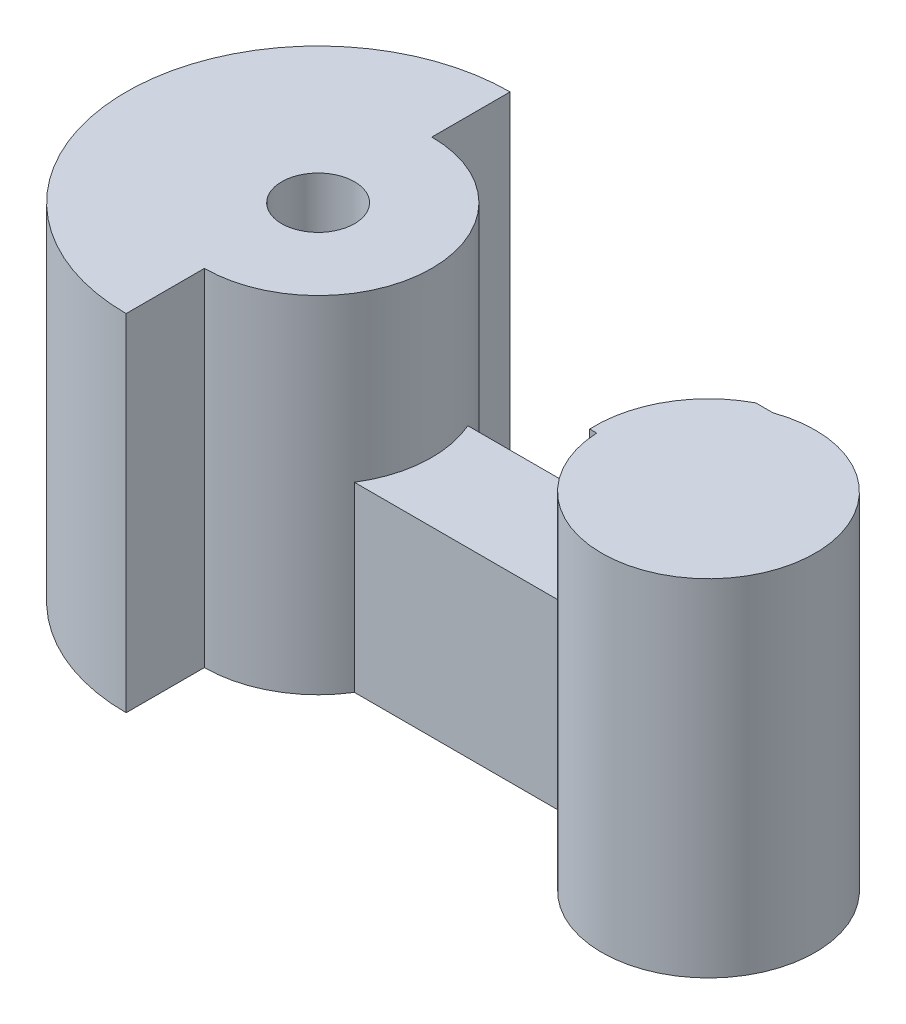
ISO-10303-21;
HEADER;
FILE_DESCRIPTION(('STEP AP214'),'2;1');
FILE_NAME('part.step','',(''),(''),'','','');
FILE_SCHEMA(('AUTOMOTIVE_DESIGN { 1 0 10303 214 1 1 1 1 }'));
ENDSEC;
DATA;
#1=APPLICATION_CONTEXT('core data for automotive mechanical design processes');
#2=APPLICATION_PROTOCOL_DEFINITION('international standard','automotive_design',2000,#1);
#3=PRODUCT_CONTEXT('',#1,'mechanical');
#4=PRODUCT('Part','Part','',(#3));
#5=PRODUCT_RELATED_PRODUCT_CATEGORY('part','',(#4));
#6=PRODUCT_DEFINITION_FORMATION('','',#4);
#7=PRODUCT_DEFINITION_CONTEXT('part definition',#1,'design');
#8=PRODUCT_DEFINITION('design','',#6,#7);
#9=PRODUCT_DEFINITION_SHAPE('','',#8);
#10=(LENGTH_UNIT() NAMED_UNIT(*) SI_UNIT(.MILLI.,.METRE.));
#11=(NAMED_UNIT(*) PLANE_ANGLE_UNIT() SI_UNIT($,.RADIAN.));
#12=(NAMED_UNIT(*) SI_UNIT($,.STERADIAN.) SOLID_ANGLE_UNIT());
#13=UNCERTAINTY_MEASURE_WITH_UNIT(LENGTH_MEASURE(1.E-05),#10,'distance_accuracy_value','');
#14=(GEOMETRIC_REPRESENTATION_CONTEXT(3) GLOBAL_UNCERTAINTY_ASSIGNED_CONTEXT((#13)) GLOBAL_UNIT_ASSIGNED_CONTEXT((#10,
#11,#12)) REPRESENTATION_CONTEXT('',''));
#15=CARTESIAN_POINT('',(0.,0.,0.));
#16=DIRECTION('',(0.,0.,1.));
#17=DIRECTION('',(1.,0.,0.));
#18=AXIS2_PLACEMENT_3D('',#15,#16,#17);
#19=CARTESIAN_POINT('',(0.,-4.826,-0.440697151861405));
#20=DIRECTION('',(0.,0.,1.));
#21=DIRECTION('',(1.,0.,0.));
#22=AXIS2_PLACEMENT_3D('',#19,#20,#21);
#23=PLANE('',#22);
#24=DIRECTION('',(0.,1.,0.));
#25=VECTOR('',#24,1.);
#26=CARTESIAN_POINT('',(16.6658362887313,0.254,-0.440697151861405));
#27=LINE('',#26,#25);
#28=CARTESIAN_POINT('',(16.6658362887313,0.254,-0.440697151861405));
#29=VERTEX_POINT('',#28);
#30=CARTESIAN_POINT('',(16.6658362887313,4.826,-0.440697151861405));
#31=VERTEX_POINT('',#30);
#32=EDGE_CURVE('E203',#29,#31,#27,.T.);
#33=ORIENTED_EDGE('',*,*,#32,.T.);
#34=DIRECTION('',(1.,0.,0.));
#35=VECTOR('',#34,1.);
#36=CARTESIAN_POINT('',(0.,4.826,-0.440697151861405));
#37=LINE('',#36,#35);
#38=CARTESIAN_POINT('',(17.1479715996403,4.826,-0.440697151861405));
#39=VERTEX_POINT('',#38);
#40=EDGE_CURVE('E178',#31,#39,#37,.T.);
#41=ORIENTED_EDGE('',*,*,#40,.T.);
#42=DIRECTION('',(0.,1.,0.));
#43=VECTOR('',#42,1.);
#44=CARTESIAN_POINT('',(17.1479715996403,-4.826,-0.440697151861405));
#45=LINE('',#44,#43);
#46=CARTESIAN_POINT('',(17.1479715996403,-4.826,-0.440697151861405));
#47=VERTEX_POINT('',#46);
#48=EDGE_CURVE('E48',#47,#39,#45,.T.);
#49=ORIENTED_EDGE('',*,*,#48,.F.);
#50=DIRECTION('',(1.,0.,0.));
#51=VECTOR('',#50,1.);
#52=CARTESIAN_POINT('',(0.,-4.826,-0.440697151861405));
#53=LINE('',#52,#51);
#54=CARTESIAN_POINT('',(8.62790716593727,-4.826,-0.440697151861405));
#55=VERTEX_POINT('',#54);
#56=EDGE_CURVE('E158',#55,#47,#53,.T.);
#57=ORIENTED_EDGE('',*,*,#56,.F.);
#58=DIRECTION('',(0.,1.,0.));
#59=VECTOR('',#58,1.);
#60=CARTESIAN_POINT('',(8.62790716593727,-4.826,-0.440697151861405));
#61=LINE('',#60,#59);
#62=CARTESIAN_POINT('',(8.62790716593727,0.254,-0.440697151861405));
#63=VERTEX_POINT('',#62);
#64=EDGE_CURVE('E11',#55,#63,#61,.T.);
#65=ORIENTED_EDGE('',*,*,#64,.T.);
#66=DIRECTION('',(-1.,0.,0.));
#67=VECTOR('',#66,1.);
#68=CARTESIAN_POINT('',(0.,0.254,-0.440697151861405));
#69=LINE('',#68,#67);
#70=EDGE_CURVE('E123',#29,#63,#69,.T.);
#71=ORIENTED_EDGE('',*,*,#70,.F.);
#72=EDGE_LOOP('',(#33,#41,#49,#57,#65,#71));
#73=FACE_BOUND('',#72,.T.);
#74=ADVANCED_FACE('F39',(#73),#23,.F.);
#75=CARTESIAN_POINT('',(0.,-4.826,2.50951856127225));
#76=DIRECTION('',(0.,0.,1.));
#77=DIRECTION('',(1.,0.,0.));
#78=AXIS2_PLACEMENT_3D('',#75,#76,#77);
#79=PLANE('',#78);
#80=DIRECTION('',(1.,0.,0.));
#81=VECTOR('',#80,1.);
#82=CARTESIAN_POINT('',(0.,4.826,2.50951856127225));
#83=LINE('',#82,#81);
#84=CARTESIAN_POINT('',(14.979501919333,4.826,2.50951856127225));
#85=VERTEX_POINT('',#84);
#86=CARTESIAN_POINT('',(15.1746561132119,4.826,2.50951856127225));
#87=VERTEX_POINT('',#86);
#88=EDGE_CURVE('E179',#85,#87,#83,.T.);
#89=ORIENTED_EDGE('',*,*,#88,.F.);
#90=DIRECTION('',(0.,1.,0.));
#91=VECTOR('',#90,1.);
#92=CARTESIAN_POINT('',(14.979501919333,0.254,2.50951856127225));
#93=LINE('',#92,#91);
#94=CARTESIAN_POINT('',(14.979501919333,0.254,2.50951856127225));
#95=VERTEX_POINT('',#94);
#96=EDGE_CURVE('E56',#95,#85,#93,.T.);
#97=ORIENTED_EDGE('',*,*,#96,.F.);
#98=DIRECTION('',(1.,0.,0.));
#99=VECTOR('',#98,1.);
#100=CARTESIAN_POINT('',(0.,0.254,2.50951856127225));
#101=LINE('',#100,#99);
#102=CARTESIAN_POINT('',(8.41194638744713,0.254,2.50951856127225));
#103=VERTEX_POINT('',#102);
#104=EDGE_CURVE('E121',#103,#95,#101,.T.);
#105=ORIENTED_EDGE('',*,*,#104,.F.);
#106=DIRECTION('',(0.,1.,0.));
#107=VECTOR('',#106,1.);
#108=CARTESIAN_POINT('',(8.41194638744713,-4.826,2.50951856127225));
#109=LINE('',#108,#107);
#110=CARTESIAN_POINT('',(8.41194638744713,-4.826,2.50951856127225));
#111=VERTEX_POINT('',#110);
#112=EDGE_CURVE('E131',#111,#103,#109,.T.);
#113=ORIENTED_EDGE('',*,*,#112,.F.);
#114=DIRECTION('',(1.,0.,0.));
#115=VECTOR('',#114,1.);
#116=CARTESIAN_POINT('',(0.,-4.826,2.50951856127225));
#117=LINE('',#116,#115);
#118=CARTESIAN_POINT('',(15.1746561132119,-4.826,2.50951856127225));
#119=VERTEX_POINT('',#118);
#120=EDGE_CURVE('E198',#111,#119,#117,.T.);
#121=ORIENTED_EDGE('',*,*,#120,.T.);
#122=DIRECTION('',(0.,1.,0.));
#123=VECTOR('',#122,1.);
#124=CARTESIAN_POINT('',(15.1746561132119,-4.826,2.50951856127225));
#125=LINE('',#124,#123);
#126=EDGE_CURVE('E139',#119,#87,#125,.T.);
#127=ORIENTED_EDGE('',*,*,#126,.T.);
#128=EDGE_LOOP('',(#89,#97,#105,#113,#121,#127));
#129=FACE_BOUND('',#128,.T.);
#130=ADVANCED_FACE('F129',(#129),#79,.T.);
#131=CARTESIAN_POINT('',(0.,4.826,0.));
#132=DIRECTION('',(0.,1.,0.));
#133=DIRECTION('',(0.,0.,1.));
#134=AXIS2_PLACEMENT_3D('',#131,#132,#133);
#135=PLANE('',#134);
#136=CARTESIAN_POINT('',(5.71797159964031,4.826,0.829302848138595));
#137=DIRECTION('',(0.,1.,0.));
#138=DIRECTION('',(0.,0.,1.));
#139=AXIS2_PLACEMENT_3D('',#136,#137,#138);
#140=CIRCLE('',#139,1.016);
#141=CARTESIAN_POINT('',(5.71797159964031,4.826,1.84530284813859));
#142=VERTEX_POINT('',#141);
#143=EDGE_CURVE('E181',#142,#142,#140,.T.);
#144=ORIENTED_EDGE('',*,*,#143,.F.);
#145=EDGE_LOOP('',(#144));
#146=FACE_BOUND('',#145,.T.);
#147=DIRECTION('',(0.,0.,1.));
#148=VECTOR('',#147,1.);
#149=CARTESIAN_POINT('',(5.71797159964031,4.826,0.));
#150=LINE('',#149,#148);
#151=CARTESIAN_POINT('',(5.71797159964031,4.826,4.0043028481386));
#152=VERTEX_POINT('',#151);
#153=CARTESIAN_POINT('',(5.71797159964031,4.826,6.18888102010782));
#154=VERTEX_POINT('',#153);
#155=EDGE_CURVE('E183',#152,#154,#150,.T.);
#156=ORIENTED_EDGE('',*,*,#155,.F.);
#157=CARTESIAN_POINT('',(5.71797159964031,4.826,0.829302848138595));
#158=DIRECTION('',(0.,1.,0.));
#159=DIRECTION('',(0.,0.,1.));
#160=AXIS2_PLACEMENT_3D('',#157,#158,#159);
#161=CIRCLE('',#160,3.175);
#162=CARTESIAN_POINT('',(5.71797159964031,4.826,-2.34569715186141));
#163=VERTEX_POINT('',#162);
#164=EDGE_CURVE('E209',#152,#163,#161,.T.);
#165=ORIENTED_EDGE('',*,*,#164,.T.);
#166=DIRECTION('',(0.,0.,1.));
#167=VECTOR('',#166,1.);
#168=CARTESIAN_POINT('',(5.71797159964031,4.826,0.));
#169=LINE('',#168,#167);
#170=CARTESIAN_POINT('',(5.71797159964031,4.826,-4.53027532383063));
#171=VERTEX_POINT('',#170);
#172=EDGE_CURVE('E212',#171,#163,#169,.T.);
#173=ORIENTED_EDGE('',*,*,#172,.F.);
#174=CARTESIAN_POINT('',(5.71797159964031,4.826,0.829302848138595));
#175=DIRECTION('',(0.,1.,0.));
#176=DIRECTION('',(0.,0.,1.));
#177=AXIS2_PLACEMENT_3D('',#174,#175,#176);
#178=CIRCLE('',#177,5.35957817196923);
#179=EDGE_CURVE('E214',#171,#154,#178,.T.);
#180=ORIENTED_EDGE('',*,*,#179,.T.);
#181=EDGE_LOOP('',(#156,#165,#173,#180));
#182=FACE_BOUND('',#181,.T.);
#183=ADVANCED_FACE('F223',(#146,#182),#135,.T.);
#184=ORIENTED_EDGE('',*,*,#40,.F.);
#185=CARTESIAN_POINT('',(18.1512297466703,4.826,2.3654089179642));
#186=DIRECTION('',(0.,1.,0.));
#187=DIRECTION('',(0.,0.,1.));
#188=AXIS2_PLACEMENT_3D('',#185,#186,#187);
#189=CIRCLE('',#188,3.175);
#190=EDGE_CURVE('E125',#31,#85,#189,.T.);
#191=ORIENTED_EDGE('',*,*,#190,.T.);
#192=ORIENTED_EDGE('',*,*,#88,.T.);
#193=CARTESIAN_POINT('',(18.1512297466703,4.826,2.3654089179642));
#194=DIRECTION('',(0.,1.,0.));
#195=DIRECTION('',(0.,0.,1.));
#196=AXIS2_PLACEMENT_3D('',#193,#194,#195);
#197=CIRCLE('',#196,2.98006009749706);
#198=EDGE_CURVE('E172',#87,#39,#197,.T.);
#199=ORIENTED_EDGE('',*,*,#198,.T.);
#200=EDGE_LOOP('',(#184,#191,#192,#199));
#201=FACE_BOUND('',#200,.T.);
#202=ADVANCED_FACE('F177',(#201),#135,.T.);
#203=CARTESIAN_POINT('',(18.1512297466703,-4.826,2.3654089179642));
#204=DIRECTION('',(0.,1.,0.));
#205=DIRECTION('',(0.,0.,1.));
#206=AXIS2_PLACEMENT_3D('',#203,#204,#205);
#207=CYLINDRICAL_SURFACE('',#206,2.98006009749706);
#208=ORIENTED_EDGE('',*,*,#48,.T.);
#209=ORIENTED_EDGE('',*,*,#198,.F.);
#210=ORIENTED_EDGE('',*,*,#126,.F.);
#211=CARTESIAN_POINT('',(18.1512297466703,-4.826,2.3654089179642));
#212=DIRECTION('',(0.,1.,0.));
#213=DIRECTION('',(0.,0.,1.));
#214=AXIS2_PLACEMENT_3D('',#211,#212,#213);
#215=CIRCLE('',#214,2.98006009749706);
#216=EDGE_CURVE('E162',#119,#47,#215,.T.);
#217=ORIENTED_EDGE('',*,*,#216,.T.);
#218=EDGE_LOOP('',(#208,#209,#210,#217));
#219=FACE_BOUND('',#218,.T.);
#220=ADVANCED_FACE('F171',(#219),#207,.T.);
#221=CARTESIAN_POINT('',(5.71797159964031,-4.826,0.829302848138595));
#222=DIRECTION('',(0.,1.,0.));
#223=DIRECTION('',(0.,0.,1.));
#224=AXIS2_PLACEMENT_3D('',#221,#222,#223);
#225=CYLINDRICAL_SURFACE('',#224,3.175);
#226=ORIENTED_EDGE('',*,*,#112,.T.);
#227=CARTESIAN_POINT('',(5.71797159964031,0.254,0.829302848138595));
#228=DIRECTION('',(0.,1.,0.));
#229=DIRECTION('',(0.,0.,1.));
#230=AXIS2_PLACEMENT_3D('',#227,#228,#229);
#231=CIRCLE('',#230,3.175);
#232=EDGE_CURVE('E117',#103,#63,#231,.T.);
#233=ORIENTED_EDGE('',*,*,#232,.T.);
#234=ORIENTED_EDGE('',*,*,#64,.F.);
#235=CARTESIAN_POINT('',(5.71797159964031,-4.826,0.829302848138595));
#236=DIRECTION('',(0.,1.,0.));
#237=DIRECTION('',(0.,0.,1.));
#238=AXIS2_PLACEMENT_3D('',#235,#236,#237);
#239=CIRCLE('',#238,3.175);
#240=CARTESIAN_POINT('',(5.71797159964031,-4.826,-2.34569715186141));
#241=VERTEX_POINT('',#240);
#242=EDGE_CURVE('E189',#55,#241,#239,.T.);
#243=ORIENTED_EDGE('',*,*,#242,.T.);
#244=DIRECTION('',(0.,1.,0.));
#245=VECTOR('',#244,1.);
#246=CARTESIAN_POINT('',(5.71797159964031,-4.826,-2.34569715186141));
#247=LINE('',#246,#245);
#248=EDGE_CURVE('E43',#241,#163,#247,.T.);
#249=ORIENTED_EDGE('',*,*,#248,.T.);
#250=ORIENTED_EDGE('',*,*,#164,.F.);
#251=DIRECTION('',(0.,1.,0.));
#252=VECTOR('',#251,1.);
#253=CARTESIAN_POINT('',(5.71797159964031,-4.826,4.0043028481386));
#254=LINE('',#253,#252);
#255=CARTESIAN_POINT('',(5.71797159964031,-4.826,4.0043028481386));
#256=VERTEX_POINT('',#255);
#257=EDGE_CURVE('E140',#256,#152,#254,.T.);
#258=ORIENTED_EDGE('',*,*,#257,.F.);
#259=EDGE_CURVE('E138',#256,#111,#239,.T.);
#260=ORIENTED_EDGE('',*,*,#259,.T.);
#261=EDGE_LOOP('',(#226,#233,#234,#243,#249,#250,#258,#260));
#262=FACE_BOUND('',#261,.T.);
#263=ADVANCED_FACE('F136',(#262),#225,.T.);
#264=CARTESIAN_POINT('',(5.71797159964031,-4.826,0.));
#265=DIRECTION('',(-1.,0.,0.));
#266=DIRECTION('',(0.,0.,1.));
#267=AXIS2_PLACEMENT_3D('',#264,#265,#266);
#268=PLANE('',#267);
#269=ORIENTED_EDGE('',*,*,#257,.T.);
#270=ORIENTED_EDGE('',*,*,#155,.T.);
#271=DIRECTION('',(0.,1.,0.));
#272=VECTOR('',#271,1.);
#273=CARTESIAN_POINT('',(5.71797159964031,-4.826,6.18888102010782));
#274=LINE('',#273,#272);
#275=CARTESIAN_POINT('',(5.71797159964031,-4.826,6.18888102010782));
#276=VERTEX_POINT('',#275);
#277=EDGE_CURVE('E145',#276,#154,#274,.T.);
#278=ORIENTED_EDGE('',*,*,#277,.F.);
#279=DIRECTION('',(0.,0.,1.));
#280=VECTOR('',#279,1.);
#281=CARTESIAN_POINT('',(5.71797159964031,-4.826,0.));
#282=LINE('',#281,#280);
#283=EDGE_CURVE('E196',#256,#276,#282,.T.);
#284=ORIENTED_EDGE('',*,*,#283,.F.);
#285=EDGE_LOOP('',(#269,#270,#278,#284));
#286=FACE_BOUND('',#285,.T.);
#287=ADVANCED_FACE('F220',(#286),#268,.F.);
#288=CARTESIAN_POINT('',(5.71797159964031,-4.826,0.829302848138595));
#289=DIRECTION('',(0.,1.,0.));
#290=DIRECTION('',(0.,0.,1.));
#291=AXIS2_PLACEMENT_3D('',#288,#289,#290);
#292=CYLINDRICAL_SURFACE('',#291,5.35957817196923);
#293=ORIENTED_EDGE('',*,*,#277,.T.);
#294=ORIENTED_EDGE('',*,*,#179,.F.);
#295=DIRECTION('',(0.,1.,0.));
#296=VECTOR('',#295,1.);
#297=CARTESIAN_POINT('',(5.71797159964031,-4.826,-4.53027532383063));
#298=LINE('',#297,#296);
#299=CARTESIAN_POINT('',(5.71797159964031,-4.826,-4.53027532383063));
#300=VERTEX_POINT('',#299);
#301=EDGE_CURVE('E149',#300,#171,#298,.T.);
#302=ORIENTED_EDGE('',*,*,#301,.F.);
#303=CARTESIAN_POINT('',(5.71797159964031,-4.826,0.829302848138595));
#304=DIRECTION('',(0.,1.,0.));
#305=DIRECTION('',(0.,0.,1.));
#306=AXIS2_PLACEMENT_3D('',#303,#304,#305);
#307=CIRCLE('',#306,5.35957817196923);
#308=EDGE_CURVE('E193',#300,#276,#307,.T.);
#309=ORIENTED_EDGE('',*,*,#308,.T.);
#310=EDGE_LOOP('',(#293,#294,#302,#309));
#311=FACE_BOUND('',#310,.T.);
#312=ADVANCED_FACE('F226',(#311),#292,.T.);
#313=CARTESIAN_POINT('',(5.71797159964031,-4.826,0.));
#314=DIRECTION('',(-1.,0.,0.));
#315=DIRECTION('',(0.,0.,1.));
#316=AXIS2_PLACEMENT_3D('',#313,#314,#315);
#317=PLANE('',#316);
#318=ORIENTED_EDGE('',*,*,#301,.T.);
#319=ORIENTED_EDGE('',*,*,#172,.T.);
#320=ORIENTED_EDGE('',*,*,#248,.F.);
#321=DIRECTION('',(0.,0.,1.));
#322=VECTOR('',#321,1.);
#323=CARTESIAN_POINT('',(5.71797159964031,-4.826,0.));
#324=LINE('',#323,#322);
#325=EDGE_CURVE('E191',#300,#241,#324,.T.);
#326=ORIENTED_EDGE('',*,*,#325,.F.);
#327=EDGE_LOOP('',(#318,#319,#320,#326));
#328=FACE_BOUND('',#327,.T.);
#329=ADVANCED_FACE('F41',(#328),#317,.F.);
#330=CARTESIAN_POINT('',(5.71797159964031,-4.826,0.829302848138595));
#331=DIRECTION('',(0.,1.,0.));
#332=DIRECTION('',(0.,0.,1.));
#333=AXIS2_PLACEMENT_3D('',#330,#331,#332);
#334=CYLINDRICAL_SURFACE('',#333,1.016);
#335=CARTESIAN_POINT('',(5.71797159964031,-4.826,0.829302848138595));
#336=DIRECTION('',(0.,1.,0.));
#337=DIRECTION('',(0.,0.,1.));
#338=AXIS2_PLACEMENT_3D('',#335,#336,#337);
#339=CIRCLE('',#338,1.016);
#340=CARTESIAN_POINT('',(5.71797159964031,-4.826,1.84530284813859));
#341=VERTEX_POINT('',#340);
#342=EDGE_CURVE('E154',#341,#341,#339,.T.);
#343=ORIENTED_EDGE('',*,*,#342,.F.);
#344=EDGE_LOOP('',(#343));
#345=FACE_BOUND('',#344,.T.);
#346=ORIENTED_EDGE('',*,*,#143,.T.);
#347=EDGE_LOOP('',(#346));
#348=FACE_BOUND('',#347,.T.);
#349=ADVANCED_FACE('F229',(#345,#348),#334,.F.);
#350=CARTESIAN_POINT('',(0.,-4.826,0.));
#351=DIRECTION('',(0.,1.,0.));
#352=DIRECTION('',(0.,0.,1.));
#353=AXIS2_PLACEMENT_3D('',#350,#351,#352);
#354=PLANE('',#353);
#355=ORIENTED_EDGE('',*,*,#242,.F.);
#356=ORIENTED_EDGE('',*,*,#56,.T.);
#357=ORIENTED_EDGE('',*,*,#216,.F.);
#358=ORIENTED_EDGE('',*,*,#120,.F.);
#359=ORIENTED_EDGE('',*,*,#259,.F.);
#360=ORIENTED_EDGE('',*,*,#283,.T.);
#361=ORIENTED_EDGE('',*,*,#308,.F.);
#362=ORIENTED_EDGE('',*,*,#325,.T.);
#363=EDGE_LOOP('',(#355,#356,#357,#358,#359,#360,#361,#362));
#364=FACE_BOUND('',#363,.T.);
#365=ORIENTED_EDGE('',*,*,#342,.T.);
#366=EDGE_LOOP('',(#365));
#367=FACE_BOUND('',#366,.T.);
#368=ADVANCED_FACE('F201',(#364,#367),#354,.F.);
#369=CARTESIAN_POINT('',(18.1512297466703,0.254,2.3654089179642));
#370=DIRECTION('',(0.,1.,0.));
#371=DIRECTION('',(0.,0.,1.));
#372=AXIS2_PLACEMENT_3D('',#369,#370,#371);
#373=CYLINDRICAL_SURFACE('',#372,3.175);
#374=ORIENTED_EDGE('',*,*,#190,.F.);
#375=ORIENTED_EDGE('',*,*,#32,.F.);
#376=CARTESIAN_POINT('',(18.1512297466703,0.254,2.3654089179642));
#377=DIRECTION('',(0.,1.,0.));
#378=DIRECTION('',(0.,0.,1.));
#379=AXIS2_PLACEMENT_3D('',#376,#377,#378);
#380=CIRCLE('',#379,3.175);
#381=EDGE_CURVE('E133',#29,#95,#380,.T.);
#382=ORIENTED_EDGE('',*,*,#381,.T.);
#383=ORIENTED_EDGE('',*,*,#96,.T.);
#384=EDGE_LOOP('',(#374,#375,#382,#383));
#385=FACE_BOUND('',#384,.T.);
#386=ADVANCED_FACE('F277',(#385),#373,.T.);
#387=CARTESIAN_POINT('',(0.,0.254,0.));
#388=DIRECTION('',(0.,1.,0.));
#389=DIRECTION('',(0.,0.,1.));
#390=AXIS2_PLACEMENT_3D('',#387,#388,#389);
#391=PLANE('',#390);
#392=ORIENTED_EDGE('',*,*,#232,.F.);
#393=ORIENTED_EDGE('',*,*,#104,.T.);
#394=ORIENTED_EDGE('',*,*,#381,.F.);
#395=ORIENTED_EDGE('',*,*,#70,.T.);
#396=EDGE_LOOP('',(#392,#393,#394,#395));
#397=FACE_BOUND('',#396,.T.);
#398=ADVANCED_FACE('F119',(#397),#391,.T.);
#399=CLOSED_SHELL('',(#74,#130,#183,#202,#220,#263,#287,#312,#329,#349,#368,#386,#398));
#400=MANIFOLD_SOLID_BREP('B2',#399);
#401=ADVANCED_BREP_SHAPE_REPRESENTATION('',(#18,#400),#14);
#402=SHAPE_DEFINITION_REPRESENTATION(#9,#401);
ENDSEC;
END-ISO-10303-21;
